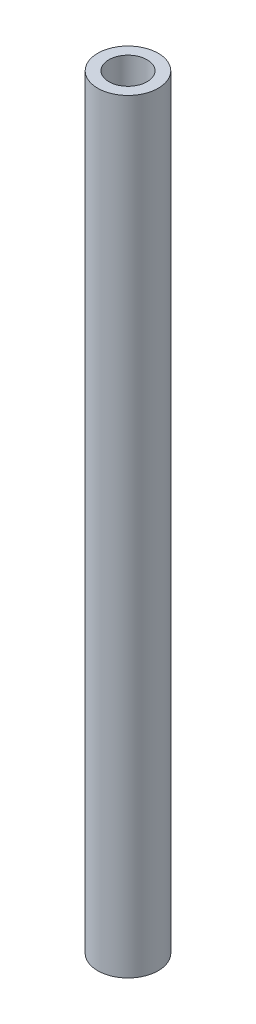
ISO-10303-21;
HEADER;
FILE_DESCRIPTION(('STEP AP214'),'2;1');
FILE_NAME('part.step','',(''),(''),'','','');
FILE_SCHEMA(('AUTOMOTIVE_DESIGN { 1 0 10303 214 1 1 1 1 }'));
ENDSEC;
DATA;
#1=APPLICATION_CONTEXT('core data for automotive mechanical design processes');
#2=APPLICATION_PROTOCOL_DEFINITION('international standard','automotive_design',2000,#1);
#3=PRODUCT_CONTEXT('',#1,'mechanical');
#4=PRODUCT('Part','Part','',(#3));
#5=PRODUCT_RELATED_PRODUCT_CATEGORY('part','',(#4));
#6=PRODUCT_DEFINITION_FORMATION('','',#4);
#7=PRODUCT_DEFINITION_CONTEXT('part definition',#1,'design');
#8=PRODUCT_DEFINITION('design','',#6,#7);
#9=PRODUCT_DEFINITION_SHAPE('','',#8);
#10=(LENGTH_UNIT() NAMED_UNIT(*) SI_UNIT(.MILLI.,.METRE.));
#11=(NAMED_UNIT(*) PLANE_ANGLE_UNIT() SI_UNIT($,.RADIAN.));
#12=(NAMED_UNIT(*) SI_UNIT($,.STERADIAN.) SOLID_ANGLE_UNIT());
#13=UNCERTAINTY_MEASURE_WITH_UNIT(LENGTH_MEASURE(1.E-05),#10,'distance_accuracy_value','');
#14=(GEOMETRIC_REPRESENTATION_CONTEXT(3) GLOBAL_UNCERTAINTY_ASSIGNED_CONTEXT((#13)) GLOBAL_UNIT_ASSIGNED_CONTEXT((#10,
#11,#12)) REPRESENTATION_CONTEXT('',''));
#15=CARTESIAN_POINT('',(0.,0.,0.));
#16=DIRECTION('',(0.,0.,1.));
#17=DIRECTION('',(1.,0.,0.));
#18=AXIS2_PLACEMENT_3D('',#15,#16,#17);
#19=CARTESIAN_POINT('',(0.,40.,0.));
#20=DIRECTION('',(0.,1.,0.));
#21=DIRECTION('',(0.,0.,1.));
#22=AXIS2_PLACEMENT_3D('',#19,#20,#21);
#23=PLANE('',#22);
#24=CARTESIAN_POINT('',(0.,40.,0.));
#25=DIRECTION('',(0.,1.,0.));
#26=DIRECTION('',(0.,0.,1.));
#27=AXIS2_PLACEMENT_3D('',#24,#25,#26);
#28=CIRCLE('',#27,1.585);
#29=CARTESIAN_POINT('',(0.,40.,1.585));
#30=VERTEX_POINT('',#29);
#31=EDGE_CURVE('E10',#30,#30,#28,.T.);
#32=ORIENTED_EDGE('',*,*,#31,.T.);
#33=EDGE_LOOP('',(#32));
#34=FACE_BOUND('',#33,.T.);
#35=CARTESIAN_POINT('',(0.,40.,0.));
#36=DIRECTION('',(0.,1.,0.));
#37=DIRECTION('',(0.,0.,1.));
#38=AXIS2_PLACEMENT_3D('',#35,#36,#37);
#39=CIRCLE('',#38,1.);
#40=CARTESIAN_POINT('',(0.,40.,1.));
#41=VERTEX_POINT('',#40);
#42=EDGE_CURVE('E46',#41,#41,#39,.T.);
#43=ORIENTED_EDGE('',*,*,#42,.F.);
#44=EDGE_LOOP('',(#43));
#45=FACE_BOUND('',#44,.T.);
#46=ADVANCED_FACE('F35',(#34,#45),#23,.T.);
#47=CARTESIAN_POINT('',(0.,0.,0.));
#48=DIRECTION('',(0.,1.,0.));
#49=DIRECTION('',(0.,0.,1.));
#50=AXIS2_PLACEMENT_3D('',#47,#48,#49);
#51=PLANE('',#50);
#52=CARTESIAN_POINT('',(0.,0.,0.));
#53=DIRECTION('',(0.,1.,0.));
#54=DIRECTION('',(0.,0.,1.));
#55=AXIS2_PLACEMENT_3D('',#52,#53,#54);
#56=CIRCLE('',#55,1.585);
#57=CARTESIAN_POINT('',(0.,0.,1.585));
#58=VERTEX_POINT('',#57);
#59=EDGE_CURVE('E39',#58,#58,#56,.T.);
#60=ORIENTED_EDGE('',*,*,#59,.F.);
#61=EDGE_LOOP('',(#60));
#62=FACE_BOUND('',#61,.T.);
#63=CARTESIAN_POINT('',(0.,0.,0.));
#64=DIRECTION('',(0.,1.,0.));
#65=DIRECTION('',(0.,0.,1.));
#66=AXIS2_PLACEMENT_3D('',#63,#64,#65);
#67=CIRCLE('',#66,1.);
#68=CARTESIAN_POINT('',(0.,0.,1.));
#69=VERTEX_POINT('',#68);
#70=EDGE_CURVE('E48',#69,#69,#67,.T.);
#71=ORIENTED_EDGE('',*,*,#70,.T.);
#72=EDGE_LOOP('',(#71));
#73=FACE_BOUND('',#72,.T.);
#74=ADVANCED_FACE('F58',(#62,#73),#51,.F.);
#75=CARTESIAN_POINT('',(0.,40.,0.));
#76=DIRECTION('',(0.,-1.,0.));
#77=DIRECTION('',(0.,0.,-1.));
#78=AXIS2_PLACEMENT_3D('',#75,#76,#77);
#79=CYLINDRICAL_SURFACE('',#78,1.585);
#80=ORIENTED_EDGE('',*,*,#31,.F.);
#81=EDGE_LOOP('',(#80));
#82=FACE_BOUND('',#81,.T.);
#83=ORIENTED_EDGE('',*,*,#59,.T.);
#84=EDGE_LOOP('',(#83));
#85=FACE_BOUND('',#84,.T.);
#86=ADVANCED_FACE('F37',(#82,#85),#79,.T.);
#87=CARTESIAN_POINT('',(0.,40.,0.));
#88=DIRECTION('',(0.,-1.,0.));
#89=DIRECTION('',(0.,0.,-1.));
#90=AXIS2_PLACEMENT_3D('',#87,#88,#89);
#91=CYLINDRICAL_SURFACE('',#90,1.);
#92=ORIENTED_EDGE('',*,*,#42,.T.);
#93=EDGE_LOOP('',(#92));
#94=FACE_BOUND('',#93,.T.);
#95=ORIENTED_EDGE('',*,*,#70,.F.);
#96=EDGE_LOOP('',(#95));
#97=FACE_BOUND('',#96,.T.);
#98=ADVANCED_FACE('F54',(#94,#97),#91,.F.);
#99=CLOSED_SHELL('',(#46,#74,#86,#98));
#100=MANIFOLD_SOLID_BREP('B2',#99);
#101=ADVANCED_BREP_SHAPE_REPRESENTATION('',(#18,#100),#14);
#102=SHAPE_DEFINITION_REPRESENTATION(#9,#101);
ENDSEC;
END-ISO-10303-21;
